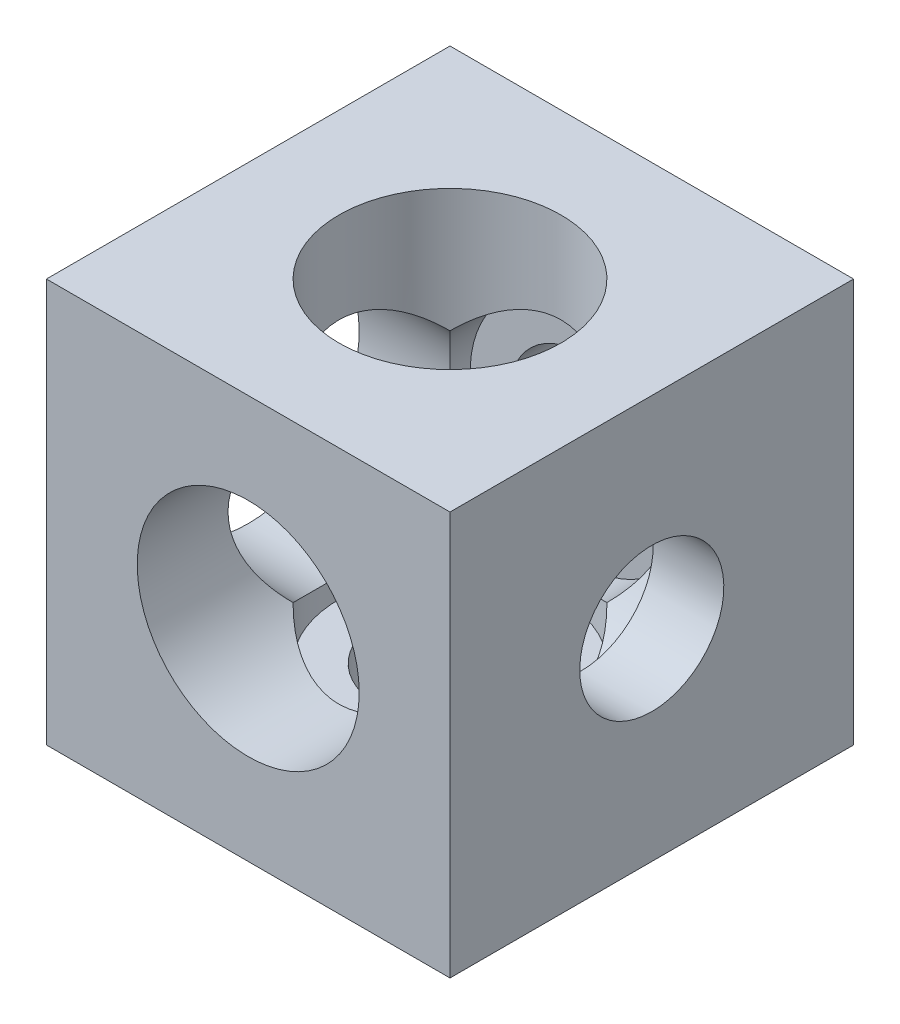
ISO-10303-21;
HEADER;
FILE_DESCRIPTION(('STEP AP214'),'2;1');
FILE_NAME('part.step','',(''),(''),'','','');
FILE_SCHEMA(('AUTOMOTIVE_DESIGN { 1 0 10303 214 1 1 1 1 }'));
ENDSEC;
DATA;
#1=APPLICATION_CONTEXT('core data for automotive mechanical design processes');
#2=APPLICATION_PROTOCOL_DEFINITION('international standard','automotive_design',2000,#1);
#3=PRODUCT_CONTEXT('',#1,'mechanical');
#4=PRODUCT('Part','Part','',(#3));
#5=PRODUCT_RELATED_PRODUCT_CATEGORY('part','',(#4));
#6=PRODUCT_DEFINITION_FORMATION('','',#4);
#7=PRODUCT_DEFINITION_CONTEXT('part definition',#1,'design');
#8=PRODUCT_DEFINITION('design','',#6,#7);
#9=PRODUCT_DEFINITION_SHAPE('','',#8);
#10=(LENGTH_UNIT() NAMED_UNIT(*) SI_UNIT(.MILLI.,.METRE.));
#11=(NAMED_UNIT(*) PLANE_ANGLE_UNIT() SI_UNIT($,.RADIAN.));
#12=(NAMED_UNIT(*) SI_UNIT($,.STERADIAN.) SOLID_ANGLE_UNIT());
#13=UNCERTAINTY_MEASURE_WITH_UNIT(LENGTH_MEASURE(1.E-05),#10,'distance_accuracy_value','');
#14=(GEOMETRIC_REPRESENTATION_CONTEXT(3) GLOBAL_UNCERTAINTY_ASSIGNED_CONTEXT((#13)) GLOBAL_UNIT_ASSIGNED_CONTEXT((#10,
#11,#12)) REPRESENTATION_CONTEXT('',''));
#15=CARTESIAN_POINT('',(0.,0.,0.));
#16=DIRECTION('',(0.,0.,1.));
#17=DIRECTION('',(1.,0.,0.));
#18=AXIS2_PLACEMENT_3D('',#15,#16,#17);
#19=CARTESIAN_POINT('',(0.,-10.,0.));
#20=DIRECTION('',(0.,1.,0.));
#21=DIRECTION('',(0.,0.,1.));
#22=AXIS2_PLACEMENT_3D('',#19,#20,#21);
#23=CYLINDRICAL_SURFACE('',#22,3.57);
#24=CARTESIAN_POINT('',(0.,-10.,0.));
#25=DIRECTION('',(0.,1.,0.));
#26=DIRECTION('',(0.,0.,1.));
#27=AXIS2_PLACEMENT_3D('',#24,#25,#26);
#28=CIRCLE('',#27,3.57);
#29=CARTESIAN_POINT('',(0.,-10.,3.57));
#30=VERTEX_POINT('',#29);
#31=EDGE_CURVE('E145',#30,#30,#28,.T.);
#32=ORIENTED_EDGE('',*,*,#31,.F.);
#33=EDGE_LOOP('',(#32));
#34=FACE_BOUND('',#33,.T.);
#35=CARTESIAN_POINT('',(0.,-6.5,0.));
#36=DIRECTION('',(0.,1.,0.));
#37=DIRECTION('',(0.,0.,1.));
#38=AXIS2_PLACEMENT_3D('',#35,#36,#37);
#39=CIRCLE('',#38,3.57);
#40=CARTESIAN_POINT('',(0.,-6.5,3.57));
#41=VERTEX_POINT('',#40);
#42=EDGE_CURVE('E113',#41,#41,#39,.F.);
#43=ORIENTED_EDGE('',*,*,#42,.F.);
#44=EDGE_LOOP('',(#43));
#45=FACE_BOUND('',#44,.T.);
#46=ADVANCED_FACE('F35',(#34,#45),#23,.F.);
#47=CARTESIAN_POINT('',(0.,0.,-25.556349186104));
#48=DIRECTION('',(0.,0.,1.));
#49=DIRECTION('',(1.,0.,0.));
#50=AXIS2_PLACEMENT_3D('',#47,#48,#49);
#51=CYLINDRICAL_SURFACE('',#50,5.5);
#52=CARTESIAN_POINT('',(0.,0.,10.));
#53=DIRECTION('',(0.,0.,1.));
#54=DIRECTION('',(1.,0.,0.));
#55=AXIS2_PLACEMENT_3D('',#52,#53,#54);
#56=CIRCLE('',#55,5.5);
#57=CARTESIAN_POINT('',(5.5,0.,10.));
#58=VERTEX_POINT('',#57);
#59=EDGE_CURVE('E158',#58,#58,#56,.T.);
#60=ORIENTED_EDGE('',*,*,#59,.T.);
#61=EDGE_LOOP('',(#60));
#62=FACE_BOUND('',#61,.T.);
#63=CARTESIAN_POINT('',(0.,0.,0.));
#64=DIRECTION('',(-0.707106781186547,0.,0.707106781186547));
#65=DIRECTION('',(0.707106781186547,0.,0.707106781186547));
#66=AXIS2_PLACEMENT_3D('',#63,#64,#65);
#67=ELLIPSE('',#66,7.77817459305202,5.5);
#68=CARTESIAN_POINT('',(3.88908729652601,3.88908729652601,3.88908729652601));
#69=VERTEX_POINT('',#68);
#70=CARTESIAN_POINT('',(3.88908729652601,-3.88908729652601,3.88908729652601));
#71=VERTEX_POINT('',#70);
#72=EDGE_CURVE('E104',#69,#71,#67,.F.);
#73=ORIENTED_EDGE('',*,*,#72,.T.);
#74=CARTESIAN_POINT('',(0.,0.,0.));
#75=DIRECTION('',(0.,0.707106781186547,0.707106781186547));
#76=DIRECTION('',(0.,-0.707106781186547,0.707106781186547));
#77=AXIS2_PLACEMENT_3D('',#74,#75,#76);
#78=ELLIPSE('',#77,7.77817459305202,5.5);
#79=CARTESIAN_POINT('',(-3.88908729652601,-3.88908729652601,3.88908729652601));
#80=VERTEX_POINT('',#79);
#81=EDGE_CURVE('E139',#71,#80,#78,.F.);
#82=ORIENTED_EDGE('',*,*,#81,.T.);
#83=CARTESIAN_POINT('',(0.,0.,0.));
#84=DIRECTION('',(0.707106781186547,0.,0.707106781186547));
#85=DIRECTION('',(-0.707106781186547,0.,0.707106781186547));
#86=AXIS2_PLACEMENT_3D('',#83,#84,#85);
#87=ELLIPSE('',#86,7.77817459305202,5.5);
#88=CARTESIAN_POINT('',(-3.88908729652601,3.88908729652601,3.88908729652601));
#89=VERTEX_POINT('',#88);
#90=EDGE_CURVE('E119',#80,#89,#87,.F.);
#91=ORIENTED_EDGE('',*,*,#90,.T.);
#92=CARTESIAN_POINT('',(0.,0.,0.));
#93=DIRECTION('',(0.,-0.707106781186547,0.707106781186547));
#94=DIRECTION('',(0.,0.707106781186547,0.707106781186547));
#95=AXIS2_PLACEMENT_3D('',#92,#93,#94);
#96=ELLIPSE('',#95,7.77817459305202,5.5);
#97=EDGE_CURVE('E57',#89,#69,#96,.F.);
#98=ORIENTED_EDGE('',*,*,#97,.T.);
#99=EDGE_LOOP('',(#73,#82,#91,#98));
#100=FACE_BOUND('',#99,.T.);
#101=ADVANCED_FACE('F202',(#62,#100),#51,.F.);
#102=CARTESIAN_POINT('',(10.,0.,0.));
#103=DIRECTION('',(-1.,0.,0.));
#104=DIRECTION('',(0.,-1.,0.));
#105=AXIS2_PLACEMENT_3D('',#102,#103,#104);
#106=CYLINDRICAL_SURFACE('',#105,3.57);
#107=CARTESIAN_POINT('',(10.,0.,0.));
#108=DIRECTION('',(-1.,0.,0.));
#109=DIRECTION('',(0.,-1.,0.));
#110=AXIS2_PLACEMENT_3D('',#107,#108,#109);
#111=CIRCLE('',#110,3.57);
#112=CARTESIAN_POINT('',(10.,-3.57,0.));
#113=VERTEX_POINT('',#112);
#114=EDGE_CURVE('E155',#113,#113,#111,.T.);
#115=ORIENTED_EDGE('',*,*,#114,.F.);
#116=EDGE_LOOP('',(#115));
#117=FACE_BOUND('',#116,.T.);
#118=CARTESIAN_POINT('',(6.5,0.,0.));
#119=DIRECTION('',(-1.,0.,0.));
#120=DIRECTION('',(0.,-1.,0.));
#121=AXIS2_PLACEMENT_3D('',#118,#119,#120);
#122=CIRCLE('',#121,3.57);
#123=CARTESIAN_POINT('',(6.5,-3.57,0.));
#124=VERTEX_POINT('',#123);
#125=EDGE_CURVE('E154',#124,#124,#122,.F.);
#126=ORIENTED_EDGE('',*,*,#125,.F.);
#127=EDGE_LOOP('',(#126));
#128=FACE_BOUND('',#127,.T.);
#129=ADVANCED_FACE('F226',(#117,#128),#106,.F.);
#130=CARTESIAN_POINT('',(0.,0.,-10.));
#131=DIRECTION('',(0.,0.,1.));
#132=DIRECTION('',(1.,0.,0.));
#133=AXIS2_PLACEMENT_3D('',#130,#131,#132);
#134=CYLINDRICAL_SURFACE('',#133,3.57);
#135=CARTESIAN_POINT('',(0.,0.,-10.));
#136=DIRECTION('',(0.,0.,1.));
#137=DIRECTION('',(1.,0.,0.));
#138=AXIS2_PLACEMENT_3D('',#135,#136,#137);
#139=CIRCLE('',#138,3.57);
#140=CARTESIAN_POINT('',(3.57,0.,-10.));
#141=VERTEX_POINT('',#140);
#142=EDGE_CURVE('E165',#141,#141,#139,.T.);
#143=ORIENTED_EDGE('',*,*,#142,.F.);
#144=EDGE_LOOP('',(#143));
#145=FACE_BOUND('',#144,.T.);
#146=CARTESIAN_POINT('',(0.,0.,-6.5));
#147=DIRECTION('',(0.,0.,1.));
#148=DIRECTION('',(1.,0.,0.));
#149=AXIS2_PLACEMENT_3D('',#146,#147,#148);
#150=CIRCLE('',#149,3.57);
#151=CARTESIAN_POINT('',(3.57,0.,-6.5));
#152=VERTEX_POINT('',#151);
#153=EDGE_CURVE('E164',#152,#152,#150,.F.);
#154=ORIENTED_EDGE('',*,*,#153,.F.);
#155=EDGE_LOOP('',(#154));
#156=FACE_BOUND('',#155,.T.);
#157=ADVANCED_FACE('F290',(#145,#156),#134,.F.);
#158=CARTESIAN_POINT('',(10.,10.,10.));
#159=DIRECTION('',(-1.,0.,0.));
#160=DIRECTION('',(0.,-1.,0.));
#161=AXIS2_PLACEMENT_3D('',#158,#159,#160);
#162=PLANE('',#161);
#163=ORIENTED_EDGE('',*,*,#114,.T.);
#164=EDGE_LOOP('',(#163));
#165=FACE_BOUND('',#164,.T.);
#166=DIRECTION('',(0.,1.,0.));
#167=VECTOR('',#166,1.);
#168=CARTESIAN_POINT('',(10.,10.,-10.));
#169=LINE('',#168,#167);
#170=CARTESIAN_POINT('',(10.,-10.,-10.));
#171=VERTEX_POINT('',#170);
#172=CARTESIAN_POINT('',(10.,10.,-10.));
#173=VERTEX_POINT('',#172);
#174=EDGE_CURVE('E168',#171,#173,#169,.T.);
#175=ORIENTED_EDGE('',*,*,#174,.T.);
#176=DIRECTION('',(0.,0.,-1.));
#177=VECTOR('',#176,1.);
#178=CARTESIAN_POINT('',(10.,10.,10.));
#179=LINE('',#178,#177);
#180=CARTESIAN_POINT('',(10.,10.,10.));
#181=VERTEX_POINT('',#180);
#182=EDGE_CURVE('E195',#181,#173,#179,.T.);
#183=ORIENTED_EDGE('',*,*,#182,.F.);
#184=DIRECTION('',(0.,1.,0.));
#185=VECTOR('',#184,1.);
#186=CARTESIAN_POINT('',(10.,10.,10.));
#187=LINE('',#186,#185);
#188=CARTESIAN_POINT('',(10.,-10.,10.));
#189=VERTEX_POINT('',#188);
#190=EDGE_CURVE('E169',#189,#181,#187,.T.);
#191=ORIENTED_EDGE('',*,*,#190,.F.);
#192=DIRECTION('',(0.,0.,-1.));
#193=VECTOR('',#192,1.);
#194=CARTESIAN_POINT('',(10.,-10.,10.));
#195=LINE('',#194,#193);
#196=EDGE_CURVE('E179',#189,#171,#195,.T.);
#197=ORIENTED_EDGE('',*,*,#196,.T.);
#198=EDGE_LOOP('',(#175,#183,#191,#197));
#199=FACE_BOUND('',#198,.T.);
#200=ADVANCED_FACE('F37',(#165,#199),#162,.F.);
#201=CARTESIAN_POINT('',(-10.,10.,10.));
#202=DIRECTION('',(0.,-1.,0.));
#203=DIRECTION('',(0.,0.,-1.));
#204=AXIS2_PLACEMENT_3D('',#201,#202,#203);
#205=PLANE('',#204);
#206=CARTESIAN_POINT('',(0.,10.,0.));
#207=DIRECTION('',(0.,1.,0.));
#208=DIRECTION('',(0.,0.,1.));
#209=AXIS2_PLACEMENT_3D('',#206,#207,#208);
#210=CIRCLE('',#209,5.5);
#211=CARTESIAN_POINT('',(0.,10.,5.5));
#212=VERTEX_POINT('',#211);
#213=EDGE_CURVE('E128',#212,#212,#210,.T.);
#214=ORIENTED_EDGE('',*,*,#213,.F.);
#215=EDGE_LOOP('',(#214));
#216=FACE_BOUND('',#215,.T.);
#217=DIRECTION('',(-1.,0.,0.));
#218=VECTOR('',#217,1.);
#219=CARTESIAN_POINT('',(-10.,10.,-10.));
#220=LINE('',#219,#218);
#221=CARTESIAN_POINT('',(-10.,10.,-10.));
#222=VERTEX_POINT('',#221);
#223=EDGE_CURVE('E182',#173,#222,#220,.T.);
#224=ORIENTED_EDGE('',*,*,#223,.T.);
#225=DIRECTION('',(0.,0.,-1.));
#226=VECTOR('',#225,1.);
#227=CARTESIAN_POINT('',(-10.,10.,10.));
#228=LINE('',#227,#226);
#229=CARTESIAN_POINT('',(-10.,10.,10.));
#230=VERTEX_POINT('',#229);
#231=EDGE_CURVE('E192',#230,#222,#228,.T.);
#232=ORIENTED_EDGE('',*,*,#231,.F.);
#233=DIRECTION('',(-1.,0.,0.));
#234=VECTOR('',#233,1.);
#235=CARTESIAN_POINT('',(-10.,10.,10.));
#236=LINE('',#235,#234);
#237=EDGE_CURVE('E172',#181,#230,#236,.T.);
#238=ORIENTED_EDGE('',*,*,#237,.F.);
#239=ORIENTED_EDGE('',*,*,#182,.T.);
#240=EDGE_LOOP('',(#224,#232,#238,#239));
#241=FACE_BOUND('',#240,.T.);
#242=ADVANCED_FACE('F347',(#216,#241),#205,.F.);
#243=CARTESIAN_POINT('',(-10.,10.,10.));
#244=DIRECTION('',(1.,0.,0.));
#245=DIRECTION('',(0.,1.,0.));
#246=AXIS2_PLACEMENT_3D('',#243,#244,#245);
#247=PLANE('',#246);
#248=CARTESIAN_POINT('',(-10.,0.,0.));
#249=DIRECTION('',(-1.,0.,0.));
#250=DIRECTION('',(0.,-1.,0.));
#251=AXIS2_PLACEMENT_3D('',#248,#249,#250);
#252=CIRCLE('',#251,5.5);
#253=CARTESIAN_POINT('',(-10.,-5.5,0.));
#254=VERTEX_POINT('',#253);
#255=EDGE_CURVE('E148',#254,#254,#252,.T.);
#256=ORIENTED_EDGE('',*,*,#255,.F.);
#257=EDGE_LOOP('',(#256));
#258=FACE_BOUND('',#257,.T.);
#259=DIRECTION('',(0.,-1.,0.));
#260=VECTOR('',#259,1.);
#261=CARTESIAN_POINT('',(-10.,10.,-10.));
#262=LINE('',#261,#260);
#263=CARTESIAN_POINT('',(-10.,-10.,-10.));
#264=VERTEX_POINT('',#263);
#265=EDGE_CURVE('E184',#222,#264,#262,.T.);
#266=ORIENTED_EDGE('',*,*,#265,.T.);
#267=DIRECTION('',(0.,0.,-1.));
#268=VECTOR('',#267,1.);
#269=CARTESIAN_POINT('',(-10.,-10.,10.));
#270=LINE('',#269,#268);
#271=CARTESIAN_POINT('',(-10.,-10.,10.));
#272=VERTEX_POINT('',#271);
#273=EDGE_CURVE('E189',#272,#264,#270,.T.);
#274=ORIENTED_EDGE('',*,*,#273,.F.);
#275=DIRECTION('',(0.,-1.,0.));
#276=VECTOR('',#275,1.);
#277=CARTESIAN_POINT('',(-10.,10.,10.));
#278=LINE('',#277,#276);
#279=EDGE_CURVE('E175',#230,#272,#278,.T.);
#280=ORIENTED_EDGE('',*,*,#279,.F.);
#281=ORIENTED_EDGE('',*,*,#231,.T.);
#282=EDGE_LOOP('',(#266,#274,#280,#281));
#283=FACE_BOUND('',#282,.T.);
#284=ADVANCED_FACE('F339',(#258,#283),#247,.F.);
#285=CARTESIAN_POINT('',(-10.,-10.,10.));
#286=DIRECTION('',(0.,1.,0.));
#287=DIRECTION('',(0.,0.,1.));
#288=AXIS2_PLACEMENT_3D('',#285,#286,#287);
#289=PLANE('',#288);
#290=ORIENTED_EDGE('',*,*,#31,.T.);
#291=EDGE_LOOP('',(#290));
#292=FACE_BOUND('',#291,.T.);
#293=DIRECTION('',(1.,0.,0.));
#294=VECTOR('',#293,1.);
#295=CARTESIAN_POINT('',(-10.,-10.,-10.));
#296=LINE('',#295,#294);
#297=EDGE_CURVE('E173',#264,#171,#296,.T.);
#298=ORIENTED_EDGE('',*,*,#297,.T.);
#299=ORIENTED_EDGE('',*,*,#196,.F.);
#300=DIRECTION('',(1.,0.,0.));
#301=VECTOR('',#300,1.);
#302=CARTESIAN_POINT('',(-10.,-10.,10.));
#303=LINE('',#302,#301);
#304=EDGE_CURVE('E177',#272,#189,#303,.T.);
#305=ORIENTED_EDGE('',*,*,#304,.F.);
#306=ORIENTED_EDGE('',*,*,#273,.T.);
#307=EDGE_LOOP('',(#298,#299,#305,#306));
#308=FACE_BOUND('',#307,.T.);
#309=ADVANCED_FACE('F331',(#292,#308),#289,.F.);
#310=CARTESIAN_POINT('',(0.,0.,10.));
#311=DIRECTION('',(0.,0.,1.));
#312=DIRECTION('',(1.,0.,0.));
#313=AXIS2_PLACEMENT_3D('',#310,#311,#312);
#314=PLANE('',#313);
#315=ORIENTED_EDGE('',*,*,#59,.F.);
#316=EDGE_LOOP('',(#315));
#317=FACE_BOUND('',#316,.T.);
#318=ORIENTED_EDGE('',*,*,#190,.T.);
#319=ORIENTED_EDGE('',*,*,#237,.T.);
#320=ORIENTED_EDGE('',*,*,#279,.T.);
#321=ORIENTED_EDGE('',*,*,#304,.T.);
#322=EDGE_LOOP('',(#318,#319,#320,#321));
#323=FACE_BOUND('',#322,.T.);
#324=ADVANCED_FACE('F323',(#317,#323),#314,.T.);
#325=CARTESIAN_POINT('',(0.,0.,-10.));
#326=DIRECTION('',(0.,0.,1.));
#327=DIRECTION('',(1.,0.,0.));
#328=AXIS2_PLACEMENT_3D('',#325,#326,#327);
#329=PLANE('',#328);
#330=ORIENTED_EDGE('',*,*,#142,.T.);
#331=EDGE_LOOP('',(#330));
#332=FACE_BOUND('',#331,.T.);
#333=ORIENTED_EDGE('',*,*,#174,.F.);
#334=ORIENTED_EDGE('',*,*,#297,.F.);
#335=ORIENTED_EDGE('',*,*,#265,.F.);
#336=ORIENTED_EDGE('',*,*,#223,.F.);
#337=EDGE_LOOP('',(#333,#334,#335,#336));
#338=FACE_BOUND('',#337,.T.);
#339=ADVANCED_FACE('F305',(#332,#338),#329,.F.);
#340=CARTESIAN_POINT('',(0.,0.,-6.5));
#341=DIRECTION('',(0.,0.,1.));
#342=DIRECTION('',(1.,0.,0.));
#343=AXIS2_PLACEMENT_3D('',#340,#341,#342);
#344=PLANE('',#343);
#345=CARTESIAN_POINT('',(0.,0.,-6.5));
#346=DIRECTION('',(0.,0.,1.));
#347=DIRECTION('',(1.,0.,0.));
#348=AXIS2_PLACEMENT_3D('',#345,#346,#347);
#349=CIRCLE('',#348,5.5);
#350=CARTESIAN_POINT('',(5.5,0.,-6.5));
#351=VERTEX_POINT('',#350);
#352=EDGE_CURVE('E161',#351,#351,#349,.F.);
#353=ORIENTED_EDGE('',*,*,#352,.F.);
#354=EDGE_LOOP('',(#353));
#355=FACE_BOUND('',#354,.T.);
#356=ORIENTED_EDGE('',*,*,#153,.T.);
#357=EDGE_LOOP('',(#356));
#358=FACE_BOUND('',#357,.T.);
#359=ADVANCED_FACE('F298',(#355,#358),#344,.T.);
#360=CARTESIAN_POINT('',(0.,0.,0.));
#361=DIRECTION('',(0.707106781186547,0.,0.707106781186547));
#362=DIRECTION('',(-0.707106781186547,0.,0.707106781186547));
#363=AXIS2_PLACEMENT_3D('',#360,#361,#362);
#364=ELLIPSE('',#363,7.77817459305202,5.5);
#365=CARTESIAN_POINT('',(3.88908729652601,-3.88908729652601,-3.88908729652601));
#366=VERTEX_POINT('',#365);
#367=CARTESIAN_POINT('',(3.88908729652601,3.88908729652601,-3.88908729652601));
#368=VERTEX_POINT('',#367);
#369=EDGE_CURVE('E112',#366,#368,#364,.T.);
#370=ORIENTED_EDGE('',*,*,#369,.T.);
#371=CARTESIAN_POINT('',(0.,0.,0.));
#372=DIRECTION('',(0.,0.707106781186547,0.707106781186547));
#373=DIRECTION('',(0.,-0.707106781186547,0.707106781186547));
#374=AXIS2_PLACEMENT_3D('',#371,#372,#373);
#375=ELLIPSE('',#374,7.77817459305202,5.5);
#376=CARTESIAN_POINT('',(-3.88908729652601,3.88908729652601,-3.88908729652601));
#377=VERTEX_POINT('',#376);
#378=EDGE_CURVE('E98',#368,#377,#375,.T.);
#379=ORIENTED_EDGE('',*,*,#378,.T.);
#380=CARTESIAN_POINT('',(0.,0.,0.));
#381=DIRECTION('',(-0.707106781186547,0.,0.707106781186547));
#382=DIRECTION('',(0.707106781186547,0.,0.707106781186547));
#383=AXIS2_PLACEMENT_3D('',#380,#381,#382);
#384=ELLIPSE('',#383,7.77817459305202,5.5);
#385=CARTESIAN_POINT('',(-3.88908729652601,-3.88908729652601,-3.88908729652601));
#386=VERTEX_POINT('',#385);
#387=EDGE_CURVE('E110',#377,#386,#384,.T.);
#388=ORIENTED_EDGE('',*,*,#387,.T.);
#389=CARTESIAN_POINT('',(0.,0.,0.));
#390=DIRECTION('',(0.,-0.707106781186547,0.707106781186547));
#391=DIRECTION('',(0.,0.707106781186547,0.707106781186547));
#392=AXIS2_PLACEMENT_3D('',#389,#390,#391);
#393=ELLIPSE('',#392,7.77817459305202,5.5);
#394=EDGE_CURVE('E50',#386,#366,#393,.T.);
#395=ORIENTED_EDGE('',*,*,#394,.T.);
#396=EDGE_LOOP('',(#370,#379,#388,#395));
#397=FACE_BOUND('',#396,.T.);
#398=ORIENTED_EDGE('',*,*,#352,.T.);
#399=EDGE_LOOP('',(#398));
#400=FACE_BOUND('',#399,.T.);
#401=ADVANCED_FACE('F108',(#397,#400),#51,.F.);
#402=CARTESIAN_POINT('',(6.5,10.,10.));
#403=DIRECTION('',(-1.,0.,0.));
#404=DIRECTION('',(0.,-1.,0.));
#405=AXIS2_PLACEMENT_3D('',#402,#403,#404);
#406=PLANE('',#405);
#407=CARTESIAN_POINT('',(6.5,0.,0.));
#408=DIRECTION('',(-1.,0.,0.));
#409=DIRECTION('',(0.,-1.,0.));
#410=AXIS2_PLACEMENT_3D('',#407,#408,#409);
#411=CIRCLE('',#410,5.5);
#412=CARTESIAN_POINT('',(6.5,-5.5,0.));
#413=VERTEX_POINT('',#412);
#414=EDGE_CURVE('E151',#413,#413,#411,.F.);
#415=ORIENTED_EDGE('',*,*,#414,.F.);
#416=EDGE_LOOP('',(#415));
#417=FACE_BOUND('',#416,.T.);
#418=ORIENTED_EDGE('',*,*,#125,.T.);
#419=EDGE_LOOP('',(#418));
#420=FACE_BOUND('',#419,.T.);
#421=ADVANCED_FACE('F208',(#417,#420),#406,.T.);
#422=CARTESIAN_POINT('',(25.5563491861041,0.,0.));
#423=DIRECTION('',(-1.,0.,0.));
#424=DIRECTION('',(0.,-1.,0.));
#425=AXIS2_PLACEMENT_3D('',#422,#423,#424);
#426=CYLINDRICAL_SURFACE('',#425,5.5);
#427=ORIENTED_EDGE('',*,*,#414,.T.);
#428=EDGE_LOOP('',(#427));
#429=FACE_BOUND('',#428,.T.);
#430=ORIENTED_EDGE('',*,*,#72,.F.);
#431=CARTESIAN_POINT('',(0.,0.,0.));
#432=DIRECTION('',(-0.707106781186548,0.707106781186547,0.));
#433=DIRECTION('',(-0.707106781186547,-0.707106781186548,0.));
#434=AXIS2_PLACEMENT_3D('',#431,#432,#433);
#435=ELLIPSE('',#434,7.77817459305202,5.5);
#436=EDGE_CURVE('E136',#69,#368,#435,.T.);
#437=ORIENTED_EDGE('',*,*,#436,.T.);
#438=ORIENTED_EDGE('',*,*,#369,.F.);
#439=CARTESIAN_POINT('',(0.,0.,0.));
#440=DIRECTION('',(-0.707106781186547,-0.707106781186548,0.));
#441=DIRECTION('',(-0.707106781186548,0.707106781186547,0.));
#442=AXIS2_PLACEMENT_3D('',#439,#440,#441);
#443=ELLIPSE('',#442,7.77817459305202,5.5);
#444=EDGE_CURVE('E142',#366,#71,#443,.T.);
#445=ORIENTED_EDGE('',*,*,#444,.T.);
#446=EDGE_LOOP('',(#430,#437,#438,#445));
#447=FACE_BOUND('',#446,.T.);
#448=ADVANCED_FACE('F206',(#429,#447),#426,.F.);
#449=ORIENTED_EDGE('',*,*,#255,.T.);
#450=EDGE_LOOP('',(#449));
#451=FACE_BOUND('',#450,.T.);
#452=ORIENTED_EDGE('',*,*,#90,.F.);
#453=CARTESIAN_POINT('',(0.,0.,0.));
#454=DIRECTION('',(-0.707106781186548,0.707106781186547,0.));
#455=DIRECTION('',(-0.707106781186547,-0.707106781186548,0.));
#456=AXIS2_PLACEMENT_3D('',#453,#454,#455);
#457=ELLIPSE('',#456,7.77817459305202,5.5);
#458=EDGE_CURVE('E12',#80,#386,#457,.F.);
#459=ORIENTED_EDGE('',*,*,#458,.T.);
#460=ORIENTED_EDGE('',*,*,#387,.F.);
#461=CARTESIAN_POINT('',(0.,0.,0.));
#462=DIRECTION('',(-0.707106781186547,-0.707106781186548,0.));
#463=DIRECTION('',(-0.707106781186548,0.707106781186547,0.));
#464=AXIS2_PLACEMENT_3D('',#461,#462,#463);
#465=ELLIPSE('',#464,7.77817459305202,5.5);
#466=EDGE_CURVE('E43',#377,#89,#465,.F.);
#467=ORIENTED_EDGE('',*,*,#466,.T.);
#468=EDGE_LOOP('',(#452,#459,#460,#467));
#469=FACE_BOUND('',#468,.T.);
#470=ADVANCED_FACE('F115',(#451,#469),#426,.F.);
#471=CARTESIAN_POINT('',(-10.,-6.5,10.));
#472=DIRECTION('',(0.,1.,0.));
#473=DIRECTION('',(0.,0.,1.));
#474=AXIS2_PLACEMENT_3D('',#471,#472,#473);
#475=PLANE('',#474);
#476=CARTESIAN_POINT('',(0.,-6.5,0.));
#477=DIRECTION('',(0.,1.,0.));
#478=DIRECTION('',(0.,0.,1.));
#479=AXIS2_PLACEMENT_3D('',#476,#477,#478);
#480=CIRCLE('',#479,5.5);
#481=CARTESIAN_POINT('',(0.,-6.5,5.5));
#482=VERTEX_POINT('',#481);
#483=EDGE_CURVE('E124',#482,#482,#480,.F.);
#484=ORIENTED_EDGE('',*,*,#483,.F.);
#485=EDGE_LOOP('',(#484));
#486=FACE_BOUND('',#485,.T.);
#487=ORIENTED_EDGE('',*,*,#42,.T.);
#488=EDGE_LOOP('',(#487));
#489=FACE_BOUND('',#488,.T.);
#490=ADVANCED_FACE('F215',(#486,#489),#475,.T.);
#491=CARTESIAN_POINT('',(0.,-25.556349186104,0.));
#492=DIRECTION('',(0.,1.,0.));
#493=DIRECTION('',(0.,0.,1.));
#494=AXIS2_PLACEMENT_3D('',#491,#492,#493);
#495=CYLINDRICAL_SURFACE('',#494,5.5);
#496=ORIENTED_EDGE('',*,*,#483,.T.);
#497=EDGE_LOOP('',(#496));
#498=FACE_BOUND('',#497,.T.);
#499=ORIENTED_EDGE('',*,*,#394,.F.);
#500=ORIENTED_EDGE('',*,*,#458,.F.);
#501=ORIENTED_EDGE('',*,*,#81,.F.);
#502=ORIENTED_EDGE('',*,*,#444,.F.);
#503=EDGE_LOOP('',(#499,#500,#501,#502));
#504=FACE_BOUND('',#503,.T.);
#505=ADVANCED_FACE('F204',(#498,#504),#495,.F.);
#506=ORIENTED_EDGE('',*,*,#213,.T.);
#507=EDGE_LOOP('',(#506));
#508=FACE_BOUND('',#507,.T.);
#509=ORIENTED_EDGE('',*,*,#97,.F.);
#510=ORIENTED_EDGE('',*,*,#466,.F.);
#511=ORIENTED_EDGE('',*,*,#378,.F.);
#512=ORIENTED_EDGE('',*,*,#436,.F.);
#513=EDGE_LOOP('',(#509,#510,#511,#512));
#514=FACE_BOUND('',#513,.T.);
#515=ADVANCED_FACE('F97',(#508,#514),#495,.F.);
#516=CLOSED_SHELL('',(#46,#101,#129,#157,#200,#242,#284,#309,#324,#339,#359,#401,#421,#448,#470,
#490,#505,#515));
#517=MANIFOLD_SOLID_BREP('B2',#516);
#518=ADVANCED_BREP_SHAPE_REPRESENTATION('',(#18,#517),#14);
#519=SHAPE_DEFINITION_REPRESENTATION(#9,#518);
ENDSEC;
END-ISO-10303-21;
